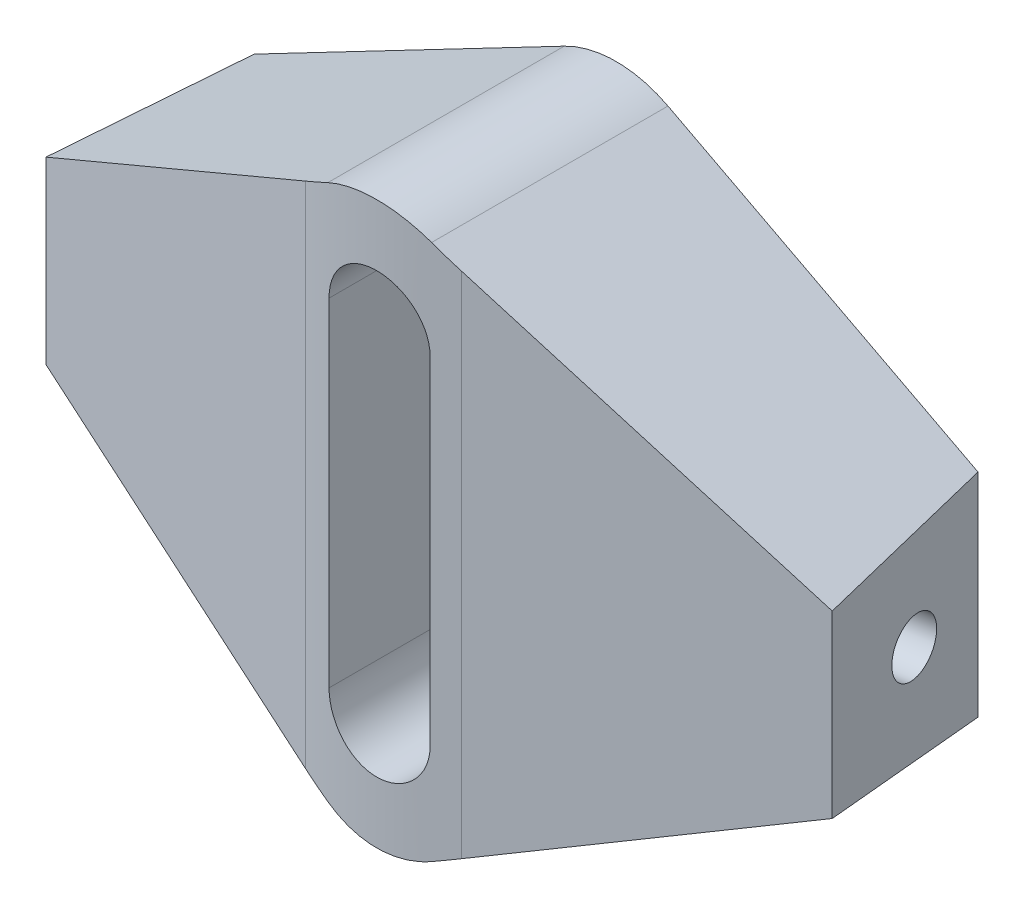
ISO-10303-21;
HEADER;
FILE_DESCRIPTION(('STEP AP214'),'2;1');
FILE_NAME('part.step','',(''),(''),'','','');
FILE_SCHEMA(('AUTOMOTIVE_DESIGN { 1 0 10303 214 1 1 1 1 }'));
ENDSEC;
DATA;
#1=APPLICATION_CONTEXT('core data for automotive mechanical design processes');
#2=APPLICATION_PROTOCOL_DEFINITION('international standard','automotive_design',2000,#1);
#3=PRODUCT_CONTEXT('',#1,'mechanical');
#4=PRODUCT('Part','Part','',(#3));
#5=PRODUCT_RELATED_PRODUCT_CATEGORY('part','',(#4));
#6=PRODUCT_DEFINITION_FORMATION('','',#4);
#7=PRODUCT_DEFINITION_CONTEXT('part definition',#1,'design');
#8=PRODUCT_DEFINITION('design','',#6,#7);
#9=PRODUCT_DEFINITION_SHAPE('','',#8);
#10=(LENGTH_UNIT() NAMED_UNIT(*) SI_UNIT(.MILLI.,.METRE.));
#11=(NAMED_UNIT(*) PLANE_ANGLE_UNIT() SI_UNIT($,.RADIAN.));
#12=(NAMED_UNIT(*) SI_UNIT($,.STERADIAN.) SOLID_ANGLE_UNIT());
#13=UNCERTAINTY_MEASURE_WITH_UNIT(LENGTH_MEASURE(1.E-05),#10,'distance_accuracy_value','');
#14=(GEOMETRIC_REPRESENTATION_CONTEXT(3) GLOBAL_UNCERTAINTY_ASSIGNED_CONTEXT((#13)) GLOBAL_UNIT_ASSIGNED_CONTEXT((#10,
#11,#12)) REPRESENTATION_CONTEXT('',''));
#15=CARTESIAN_POINT('',(0.,0.,0.));
#16=DIRECTION('',(0.,0.,1.));
#17=DIRECTION('',(1.,0.,0.));
#18=AXIS2_PLACEMENT_3D('',#15,#16,#17);
#19=CARTESIAN_POINT('',(16.1108145786646,-12.5,0.));
#20=DIRECTION('',(0.984807753012209,0.,-0.173648177666927));
#21=DIRECTION('',(-0.173648177666927,0.,-0.984807753012209));
#22=AXIS2_PLACEMENT_3D('',#19,#20,#21);
#23=PLANE('',#22);
#24=DIRECTION('',(0.,1.,0.));
#25=VECTOR('',#24,1.);
#26=CARTESIAN_POINT('',(16.1108145786646,0.,0.));
#27=LINE('',#26,#25);
#28=CARTESIAN_POINT('',(16.1108145786646,-4.72548656197076,0.));
#29=VERTEX_POINT('',#28);
#30=CARTESIAN_POINT('',(16.1108145786646,4.72548656197075,0.));
#31=VERTEX_POINT('',#30);
#32=EDGE_CURVE('E144',#29,#31,#27,.T.);
#33=ORIENTED_EDGE('',*,*,#32,.T.);
#34=DIRECTION('',(0.172938517632426,-0.0903152082238665,0.980783070960433));
#35=VECTOR('',#34,1.);
#36=CARTESIAN_POINT('',(19.0950873519284,3.166983455757,16.9246519237916));
#37=LINE('',#36,#35);
#38=CARTESIAN_POINT('',(17.5,3.99999999999999,7.87846202409767));
#39=VERTEX_POINT('',#38);
#40=EDGE_CURVE('E156',#31,#39,#37,.T.);
#41=ORIENTED_EDGE('',*,*,#40,.T.);
#42=DIRECTION('',(0.,1.,0.));
#43=VECTOR('',#42,1.);
#44=CARTESIAN_POINT('',(17.5,-12.5,7.87846202409767));
#45=LINE('',#44,#43);
#46=CARTESIAN_POINT('',(17.5,-4.,7.87846202409767));
#47=VERTEX_POINT('',#46);
#48=EDGE_CURVE('E326',#47,#39,#45,.T.);
#49=ORIENTED_EDGE('',*,*,#48,.F.);
#50=DIRECTION('',(0.172938517632426,0.0903152082238665,0.980783070960433));
#51=VECTOR('',#50,1.);
#52=CARTESIAN_POINT('',(19.0950873519284,-3.166983455757,16.9246519237916));
#53=LINE('',#52,#51);
#54=EDGE_CURVE('E306',#29,#47,#53,.T.);
#55=ORIENTED_EDGE('',*,*,#54,.F.);
#56=EDGE_LOOP('',(#33,#41,#49,#55));
#57=FACE_BOUND('',#56,.T.);
#58=CARTESIAN_POINT('',(16.7185832004988,0.,3.44682713554273));
#59=DIRECTION('',(-0.984807753012209,0.,0.173648177666927));
#60=DIRECTION('',(0.173648177666927,0.,0.984807753012209));
#61=AXIS2_PLACEMENT_3D('',#58,#59,#60);
#62=CIRCLE('',#61,1.23);
#63=CARTESIAN_POINT('',(16.9321704590292,0.,4.65814067174775));
#64=VERTEX_POINT('',#63);
#65=EDGE_CURVE('E335',#64,#64,#62,.T.);
#66=ORIENTED_EDGE('',*,*,#65,.T.);
#67=EDGE_LOOP('',(#66));
#68=FACE_BOUND('',#67,.T.);
#69=ADVANCED_FACE('F36',(#57,#68),#23,.T.);
#70=CARTESIAN_POINT('',(-5.39138022221066,-10.3235913636028,20.));
#71=DIRECTION('',(0.462914129050303,0.886403130142036,0.));
#72=DIRECTION('',(-0.886403130142036,0.462914129050303,0.));
#73=AXIS2_PLACEMENT_3D('',#70,#71,#72);
#74=PLANE('',#73);
#75=CARTESIAN_POINT('',(0.,-13.1391794353007,-9.34434805121913));
#76=DIRECTION('',(0.462914129050303,0.886403130142036,0.));
#77=DIRECTION('',(-0.886403130142036,0.462914129050303,0.));
#78=AXIS2_PLACEMENT_3D('',#75,#76,#77);
#79=ELLIPSE('',#78,22.5630972182998,20.);
#80=CARTESIAN_POINT('',(-3.47296355333856,-11.3254630303738,10.351807009025));
#81=VERTEX_POINT('',#80);
#82=CARTESIAN_POINT('',(-2.30880974382523,-11.9334293478271,10.5219399152536));
#83=VERTEX_POINT('',#82);
#84=EDGE_CURVE('E224',#81,#83,#79,.T.);
#85=ORIENTED_EDGE('',*,*,#84,.F.);
#86=DIRECTION('',(0.875770708624108,-0.457361465731212,0.1544220048446));
#87=VECTOR('',#86,1.);
#88=CARTESIAN_POINT('',(-4.04082844454331,-11.0289019369037,10.2516771073086));
#89=LINE('',#88,#87);
#90=CARTESIAN_POINT('',(-17.5,-4.,7.87846202409767));
#91=VERTEX_POINT('',#90);
#92=EDGE_CURVE('E155',#91,#81,#89,.T.);
#93=ORIENTED_EDGE('',*,*,#92,.F.);
#94=DIRECTION('',(-0.172938517632426,0.0903152082238665,0.980783070960433));
#95=VECTOR('',#94,1.);
#96=CARTESIAN_POINT('',(-19.0950873519284,-3.166983455757,16.9246519237916));
#97=LINE('',#96,#95);
#98=CARTESIAN_POINT('',(-16.1108145786646,-4.72548656197076,0.));
#99=VERTEX_POINT('',#98);
#100=EDGE_CURVE('E138',#99,#91,#97,.T.);
#101=ORIENTED_EDGE('',*,*,#100,.F.);
#102=DIRECTION('',(0.886403130142036,-0.462914129050303,0.));
#103=VECTOR('',#102,1.);
#104=CARTESIAN_POINT('',(-5.39138022221066,-10.3235913636028,0.));
#105=LINE('',#104,#103);
#106=CARTESIAN_POINT('',(-2.30880974382523,-11.9334293478271,0.));
#107=VERTEX_POINT('',#106);
#108=EDGE_CURVE('E153',#99,#107,#105,.T.);
#109=ORIENTED_EDGE('',*,*,#108,.T.);
#110=DIRECTION('',(0.,0.,-1.));
#111=VECTOR('',#110,1.);
#112=CARTESIAN_POINT('',(-2.30880974382523,-11.9334293478271,20.));
#113=LINE('',#112,#111);
#114=EDGE_CURVE('E145',#83,#107,#113,.T.);
#115=ORIENTED_EDGE('',*,*,#114,.F.);
#116=EDGE_LOOP('',(#85,#93,#101,#109,#115));
#117=FACE_BOUND('',#116,.T.);
#118=ADVANCED_FACE('F151',(#117),#74,.F.);
#119=CARTESIAN_POINT('',(0.,-7.51244485978015,20.));
#120=DIRECTION('',(0.,0.,-1.));
#121=DIRECTION('',(-1.,0.,0.));
#122=AXIS2_PLACEMENT_3D('',#119,#120,#121);
#123=CYLINDRICAL_SURFACE('',#122,4.98755514021987);
#124=CARTESIAN_POINT('',(-2.30880974382523,-11.9334293478271,10.5219399152536));
#125=CARTESIAN_POINT('',(-2.18748867748641,-11.9968037626739,10.5360496031578));
#126=CARTESIAN_POINT('',(-2.06346541190383,-12.0552015587296,10.5493273415755));
#127=CARTESIAN_POINT('',(-1.81085966215703,-12.1616645707957,10.5739044822806));
#128=CARTESIAN_POINT('',(-1.68227678686002,-12.2097288978698,10.5852037143517));
#129=CARTESIAN_POINT('',(-1.42160133508556,-12.2950746252358,10.605492612942));
#130=CARTESIAN_POINT('',(-1.28951394133634,-12.3323710745319,10.614485500785));
#131=CARTESIAN_POINT('',(-1.02258073349888,-12.395973870975,10.629940215839));
#132=CARTESIAN_POINT('',(-0.887735082620546,-12.4222808664214,10.6364021923543));
#133=CARTESIAN_POINT('',(-0.616021747323678,-12.463721394292,10.6466256540543));
#134=CARTESIAN_POINT('',(-0.479151264248759,-12.4788376254919,10.6503829574941));
#135=CARTESIAN_POINT('',(-0.204581162158827,-12.4977019611016,10.6550768877698));
#136=CARTESIAN_POINT('',(-0.0668815486817889,-12.5014501413574,10.6560135334246));
#137=CARTESIAN_POINT('',(0.208352484267639,-12.4975466099893,10.655040188063));
#138=CARTESIAN_POINT('',(0.345886894330772,-12.4898942772386,10.6531300419468));
#139=CARTESIAN_POINT('',(0.619721955921612,-12.4632593721777,10.6465171515566));
#140=CARTESIAN_POINT('',(0.756023169097858,-12.4442822517999,10.6418157510425));
#141=CARTESIAN_POINT('',(1.01480058236893,-12.3972845216659,10.6302729041653));
#142=CARTESIAN_POINT('',(1.13745507700392,-12.3701852877371,10.623651059378));
#143=CARTESIAN_POINT('',(1.38024881956069,-12.3068540471235,10.6083387928256));
#144=CARTESIAN_POINT('',(1.50038814778095,-12.2706223324827,10.5996484372091));
#145=CARTESIAN_POINT('',(1.73754976870389,-12.1892333730428,10.5803870432731));
#146=CARTESIAN_POINT('',(1.85456960571935,-12.1440693191422,10.5698145708383));
#147=CARTESIAN_POINT('',(2.08474786211003,-12.0451317763272,10.5470389133088));
#148=CARTESIAN_POINT('',(2.19790628548275,-11.9913582963261,10.5348357299024));
#149=CARTESIAN_POINT('',(2.30880974382523,-11.9334293478271,10.5219399152536));
#150=B_SPLINE_CURVE_WITH_KNOTS('',3,(#124,#125,#126,#127,#128,#129,#130,#131,#132,#133,#134,
#135,#136,#137,#138,#139,#140,#141,#142,#143,#144,#145,#146,#147,#148,#149),.UNSPECIFIED.,.F.,
.F.,(4,2,2,2,2,2,2,2,2,2,2,2,4),(0.,0.412695108790664,0.825425705475821,1.23757665320062,
1.64970328352615,2.06246574973173,2.47522546204235,2.88800766329875,3.3005913047803,
3.67758281135736,4.05456226379936,4.43183020219751,4.80909775002098),.UNSPECIFIED.);
#151=CARTESIAN_POINT('',(2.30880974382523,-11.9334293478271,10.5219399152536));
#152=VERTEX_POINT('',#151);
#153=EDGE_CURVE('E287',#83,#152,#150,.T.);
#154=ORIENTED_EDGE('',*,*,#153,.F.);
#155=ORIENTED_EDGE('',*,*,#114,.T.);
#156=CARTESIAN_POINT('',(0.,-7.51244485978015,0.));
#157=DIRECTION('',(0.,0.,1.));
#158=DIRECTION('',(1.,0.,0.));
#159=AXIS2_PLACEMENT_3D('',#156,#157,#158);
#160=CIRCLE('',#159,4.98755514021987);
#161=CARTESIAN_POINT('',(2.30880974382523,-11.9334293478271,0.));
#162=VERTEX_POINT('',#161);
#163=EDGE_CURVE('E161',#107,#162,#160,.T.);
#164=ORIENTED_EDGE('',*,*,#163,.T.);
#165=DIRECTION('',(0.,0.,-1.));
#166=VECTOR('',#165,1.);
#167=CARTESIAN_POINT('',(2.30880974382523,-11.9334293478271,20.));
#168=LINE('',#167,#166);
#169=EDGE_CURVE('E186',#152,#162,#168,.T.);
#170=ORIENTED_EDGE('',*,*,#169,.F.);
#171=EDGE_LOOP('',(#154,#155,#164,#170));
#172=FACE_BOUND('',#171,.T.);
#173=ADVANCED_FACE('F280',(#172),#123,.T.);
#174=CARTESIAN_POINT('',(5.39138022221066,-10.3235913636028,20.));
#175=DIRECTION('',(0.462914129050303,-0.886403130142036,0.));
#176=DIRECTION('',(0.886403130142036,0.462914129050303,0.));
#177=AXIS2_PLACEMENT_3D('',#174,#175,#176);
#178=PLANE('',#177);
#179=DIRECTION('',(-0.886403130142036,-0.462914129050303,0.));
#180=VECTOR('',#179,1.);
#181=CARTESIAN_POINT('',(5.39138022221066,-10.3235913636028,0.));
#182=LINE('',#181,#180);
#183=EDGE_CURVE('E164',#29,#162,#182,.T.);
#184=ORIENTED_EDGE('',*,*,#183,.F.);
#185=ORIENTED_EDGE('',*,*,#54,.T.);
#186=DIRECTION('',(-0.875770708624108,-0.457361465731212,0.154422004844599));
#187=VECTOR('',#186,1.);
#188=CARTESIAN_POINT('',(4.04082844454331,-11.0289019369037,10.2516771073086));
#189=LINE('',#188,#187);
#190=CARTESIAN_POINT('',(3.47296355333855,-11.3254630303738,10.351807009025));
#191=VERTEX_POINT('',#190);
#192=EDGE_CURVE('E220',#47,#191,#189,.T.);
#193=ORIENTED_EDGE('',*,*,#192,.T.);
#194=CARTESIAN_POINT('',(0.,-13.1391794353007,-9.34434805121913));
#195=DIRECTION('',(0.462914129050303,-0.886403130142036,0.));
#196=DIRECTION('',(0.886403130142036,0.462914129050303,0.));
#197=AXIS2_PLACEMENT_3D('',#194,#195,#196);
#198=ELLIPSE('',#197,22.5630972182998,20.);
#199=EDGE_CURVE('E291',#191,#152,#198,.T.);
#200=ORIENTED_EDGE('',*,*,#199,.T.);
#201=ORIENTED_EDGE('',*,*,#169,.T.);
#202=EDGE_LOOP('',(#184,#185,#193,#200,#201));
#203=FACE_BOUND('',#202,.T.);
#204=ADVANCED_FACE('F276',(#203),#178,.T.);
#205=CARTESIAN_POINT('',(5.39138022221066,10.3235913636028,20.));
#206=DIRECTION('',(-0.462914129050303,-0.886403130142036,0.));
#207=DIRECTION('',(0.886403130142036,-0.462914129050303,0.));
#208=AXIS2_PLACEMENT_3D('',#205,#206,#207);
#209=PLANE('',#208);
#210=ORIENTED_EDGE('',*,*,#40,.F.);
#211=DIRECTION('',(-0.886403130142036,0.462914129050303,0.));
#212=VECTOR('',#211,1.);
#213=CARTESIAN_POINT('',(5.39138022221066,10.3235913636028,0.));
#214=LINE('',#213,#212);
#215=CARTESIAN_POINT('',(2.30880974382523,11.9334293478271,0.));
#216=VERTEX_POINT('',#215);
#217=EDGE_CURVE('E172',#31,#216,#214,.T.);
#218=ORIENTED_EDGE('',*,*,#217,.T.);
#219=DIRECTION('',(0.,0.,-1.));
#220=VECTOR('',#219,1.);
#221=CARTESIAN_POINT('',(2.30880974382523,11.9334293478271,20.));
#222=LINE('',#221,#220);
#223=CARTESIAN_POINT('',(2.30880974382523,11.9334293478271,10.5219399152536));
#224=VERTEX_POINT('',#223);
#225=EDGE_CURVE('E182',#224,#216,#222,.T.);
#226=ORIENTED_EDGE('',*,*,#225,.F.);
#227=CARTESIAN_POINT('',(0.,13.1391794353007,-9.34434805121913));
#228=DIRECTION('',(-0.462914129050303,-0.886403130142036,0.));
#229=DIRECTION('',(-0.886403130142036,0.462914129050303,0.));
#230=AXIS2_PLACEMENT_3D('',#227,#228,#229);
#231=ELLIPSE('',#230,22.5630972182998,20.);
#232=CARTESIAN_POINT('',(3.47296355333855,11.3254630303738,10.351807009025));
#233=VERTEX_POINT('',#232);
#234=EDGE_CURVE('E263',#233,#224,#231,.T.);
#235=ORIENTED_EDGE('',*,*,#234,.F.);
#236=DIRECTION('',(-0.875770708624108,0.457361465731212,0.154422004844599));
#237=VECTOR('',#236,1.);
#238=CARTESIAN_POINT('',(4.04082844454331,11.0289019369037,10.2516771073086));
#239=LINE('',#238,#237);
#240=EDGE_CURVE('E12',#39,#233,#239,.T.);
#241=ORIENTED_EDGE('',*,*,#240,.F.);
#242=EDGE_LOOP('',(#210,#218,#226,#235,#241));
#243=FACE_BOUND('',#242,.T.);
#244=ADVANCED_FACE('F271',(#243),#209,.F.);
#245=CARTESIAN_POINT('',(0.,7.51244485978015,20.));
#246=DIRECTION('',(0.,0.,-1.));
#247=DIRECTION('',(-1.,0.,0.));
#248=AXIS2_PLACEMENT_3D('',#245,#246,#247);
#249=CYLINDRICAL_SURFACE('',#248,4.98755514021987);
#250=DIRECTION('',(0.,0.,-1.));
#251=VECTOR('',#250,1.);
#252=CARTESIAN_POINT('',(-2.30880974382523,11.9334293478271,20.));
#253=LINE('',#252,#251);
#254=CARTESIAN_POINT('',(-2.30880974382523,11.9334293478271,10.5219399152536));
#255=VERTEX_POINT('',#254);
#256=CARTESIAN_POINT('',(-2.30880974382523,11.9334293478271,0.));
#257=VERTEX_POINT('',#256);
#258=EDGE_CURVE('E180',#255,#257,#253,.T.);
#259=ORIENTED_EDGE('',*,*,#258,.F.);
#260=CARTESIAN_POINT('',(-2.30880974382523,11.9334293478271,10.5219399152536));
#261=CARTESIAN_POINT('',(-2.18748867748641,11.9968037626739,10.5360496031578));
#262=CARTESIAN_POINT('',(-2.06346541190383,12.0552015587296,10.5493273415755));
#263=CARTESIAN_POINT('',(-1.81085966215703,12.1616645707957,10.5739044822806));
#264=CARTESIAN_POINT('',(-1.68227678686002,12.2097288978698,10.5852037143517));
#265=CARTESIAN_POINT('',(-1.42160133508556,12.2950746252358,10.605492612942));
#266=CARTESIAN_POINT('',(-1.28951394133634,12.3323710745319,10.614485500785));
#267=CARTESIAN_POINT('',(-1.02258073349888,12.395973870975,10.629940215839));
#268=CARTESIAN_POINT('',(-0.887735082620547,12.4222808664214,10.6364021923543));
#269=CARTESIAN_POINT('',(-0.616021747323679,12.463721394292,10.6466256540543));
#270=CARTESIAN_POINT('',(-0.47915126424876,12.4788376254919,10.6503829574941));
#271=CARTESIAN_POINT('',(-0.204581162158828,12.4977019611016,10.6550768877698));
#272=CARTESIAN_POINT('',(-0.0668815486817902,12.5014501413574,10.6560135334246));
#273=CARTESIAN_POINT('',(0.208352484267637,12.4975466099893,10.6550401880631));
#274=CARTESIAN_POINT('',(0.34588689433077,12.4898942772386,10.6531300419468));
#275=CARTESIAN_POINT('',(0.619721955921611,12.4632593721777,10.6465171515566));
#276=CARTESIAN_POINT('',(0.756023169097856,12.4442822517999,10.6418157510425));
#277=CARTESIAN_POINT('',(1.01480058236893,12.3972845216659,10.6302729041653));
#278=CARTESIAN_POINT('',(1.13745507700392,12.3701852877371,10.623651059378));
#279=CARTESIAN_POINT('',(1.38024881956069,12.3068540471235,10.6083387928256));
#280=CARTESIAN_POINT('',(1.50038814778095,12.2706223324827,10.5996484372091));
#281=CARTESIAN_POINT('',(1.73754976870389,12.1892333730428,10.5803870432731));
#282=CARTESIAN_POINT('',(1.85456960571935,12.1440693191422,10.5698145708383));
#283=CARTESIAN_POINT('',(2.08474786211003,12.0451317763272,10.5470389133088));
#284=CARTESIAN_POINT('',(2.19790628548274,11.9913582963261,10.5348357299024));
#285=CARTESIAN_POINT('',(2.30880974382523,11.9334293478271,10.5219399152536));
#286=B_SPLINE_CURVE_WITH_KNOTS('',3,(#260,#261,#262,#263,#264,#265,#266,#267,#268,#269,#270,
#271,#272,#273,#274,#275,#276,#277,#278,#279,#280,#281,#282,#283,#284,#285),.UNSPECIFIED.,.F.,
.F.,(4,2,2,2,2,2,2,2,2,2,2,2,4),(0.,0.412695108790664,0.825425705475821,1.23757665320062,
1.64970328352615,2.06246574973173,2.47522546204234,2.88800766329874,3.30059130478029,
3.67758281135736,4.05456226379936,4.4318302021975,4.80909775002098),.UNSPECIFIED.);
#287=EDGE_CURVE('E257',#255,#224,#286,.T.);
#288=ORIENTED_EDGE('',*,*,#287,.T.);
#289=ORIENTED_EDGE('',*,*,#225,.T.);
#290=CARTESIAN_POINT('',(0.,7.51244485978015,0.));
#291=DIRECTION('',(0.,0.,1.));
#292=DIRECTION('',(1.,0.,0.));
#293=AXIS2_PLACEMENT_3D('',#290,#291,#292);
#294=CIRCLE('',#293,4.98755514021987);
#295=EDGE_CURVE('E175',#257,#216,#294,.F.);
#296=ORIENTED_EDGE('',*,*,#295,.F.);
#297=EDGE_LOOP('',(#259,#288,#289,#296));
#298=FACE_BOUND('',#297,.T.);
#299=ADVANCED_FACE('F265',(#298),#249,.T.);
#300=CARTESIAN_POINT('',(-5.39138022221066,10.3235913636028,20.));
#301=DIRECTION('',(-0.462914129050303,0.886403130142036,0.));
#302=DIRECTION('',(-0.886403130142036,-0.462914129050303,0.));
#303=AXIS2_PLACEMENT_3D('',#300,#301,#302);
#304=PLANE('',#303);
#305=DIRECTION('',(0.875770708624108,0.457361465731212,0.1544220048446));
#306=VECTOR('',#305,1.);
#307=CARTESIAN_POINT('',(-4.04082844454331,11.0289019369037,10.2516771073086));
#308=LINE('',#307,#306);
#309=CARTESIAN_POINT('',(-17.5,3.99999999999999,7.87846202409767));
#310=VERTEX_POINT('',#309);
#311=CARTESIAN_POINT('',(-3.47296355333855,11.3254630303738,10.351807009025));
#312=VERTEX_POINT('',#311);
#313=EDGE_CURVE('E311',#310,#312,#308,.T.);
#314=ORIENTED_EDGE('',*,*,#313,.T.);
#315=CARTESIAN_POINT('',(0.,13.1391794353007,-9.34434805121913));
#316=DIRECTION('',(-0.462914129050303,0.886403130142036,0.));
#317=DIRECTION('',(0.886403130142036,0.462914129050303,0.));
#318=AXIS2_PLACEMENT_3D('',#315,#316,#317);
#319=ELLIPSE('',#318,22.5630972182998,20.);
#320=EDGE_CURVE('E207',#312,#255,#319,.T.);
#321=ORIENTED_EDGE('',*,*,#320,.T.);
#322=ORIENTED_EDGE('',*,*,#258,.T.);
#323=DIRECTION('',(0.886403130142036,0.462914129050303,0.));
#324=VECTOR('',#323,1.);
#325=CARTESIAN_POINT('',(-5.39138022221066,10.3235913636028,0.));
#326=LINE('',#325,#324);
#327=CARTESIAN_POINT('',(-16.1108145786646,4.72548656197076,0.));
#328=VERTEX_POINT('',#327);
#329=EDGE_CURVE('E177',#328,#257,#326,.T.);
#330=ORIENTED_EDGE('',*,*,#329,.F.);
#331=DIRECTION('',(-0.172938517632426,-0.0903152082238665,0.980783070960433));
#332=VECTOR('',#331,1.);
#333=CARTESIAN_POINT('',(-19.0950873519284,3.166983455757,16.9246519237916));
#334=LINE('',#333,#332);
#335=EDGE_CURVE('E60',#328,#310,#334,.T.);
#336=ORIENTED_EDGE('',*,*,#335,.T.);
#337=EDGE_LOOP('',(#314,#321,#322,#330,#336));
#338=FACE_BOUND('',#337,.T.);
#339=ADVANCED_FACE('F270',(#338),#304,.T.);
#340=CARTESIAN_POINT('',(0.,7.51244485978015,20.));
#341=DIRECTION('',(0.,0.,-1.));
#342=DIRECTION('',(-1.,0.,0.));
#343=AXIS2_PLACEMENT_3D('',#340,#341,#342);
#344=CYLINDRICAL_SURFACE('',#343,2.25);
#345=DIRECTION('',(0.,0.,-1.));
#346=VECTOR('',#345,1.);
#347=CARTESIAN_POINT('',(2.25,7.51244485978015,20.));
#348=LINE('',#347,#346);
#349=CARTESIAN_POINT('',(2.25,7.51244485978015,10.5286864427881));
#350=VERTEX_POINT('',#349);
#351=CARTESIAN_POINT('',(2.25,7.51244485978015,0.));
#352=VERTEX_POINT('',#351);
#353=EDGE_CURVE('E183',#350,#352,#348,.T.);
#354=ORIENTED_EDGE('',*,*,#353,.F.);
#355=CARTESIAN_POINT('',(2.25,7.51244485978015,10.5286864427881));
#356=CARTESIAN_POINT('',(2.24999981834973,7.57553336458192,10.5286847199834));
#357=CARTESIAN_POINT('',(2.24734489031851,7.63859144859624,10.5289872448017));
#358=CARTESIAN_POINT('',(2.23675486634087,7.76425246366442,10.5301826254157));
#359=CARTESIAN_POINT('',(2.22882014754874,7.82685542690629,10.531075439045));
#360=CARTESIAN_POINT('',(2.19717887631467,8.01317320112749,10.5346077654562));
#361=CARTESIAN_POINT('',(2.16563495617706,8.13563372811299,10.5381012958475));
#362=CARTESIAN_POINT('',(2.08255229295352,8.37347467970841,10.546974173957));
#363=CARTESIAN_POINT('',(2.03100648638886,8.48885258646811,10.5523541878044));
#364=CARTESIAN_POINT('',(1.90940115019305,8.70932672710842,10.5643913937831));
#365=CARTESIAN_POINT('',(1.8393434796092,8.81442399196745,10.5710484576487));
#366=CARTESIAN_POINT('',(1.68237119375747,9.01180934005758,10.5849229088055));
#367=CARTESIAN_POINT('',(1.595390740805,9.1040448978489,10.5921424162753));
#368=CARTESIAN_POINT('',(1.40717183353723,9.27265298854349,10.6063100128893));
#369=CARTESIAN_POINT('',(1.30593121133241,9.34902310514019,10.6132580605595));
#370=CARTESIAN_POINT('',(1.09174158430743,9.48390617220076,10.6261207361433));
#371=CARTESIAN_POINT('',(0.978762329645395,9.54237137341306,10.6320325830633));
#372=CARTESIAN_POINT('',(0.744518780663257,9.63947663498934,10.6421328514608));
#373=CARTESIAN_POINT('',(0.623255233735557,9.67811848110757,10.6463214281697));
#374=CARTESIAN_POINT('',(0.376423789207964,9.7343266101197,10.6524885455419));
#375=CARTESIAN_POINT('',(0.250876286478719,9.75198142016725,10.6544763669369));
#376=CARTESIAN_POINT('',(-0.00141740258608267,9.76598856411787,10.6560496513785));
#377=CARTESIAN_POINT('',(-0.128163579383982,9.76234106737784,10.655635133524));
#378=CARTESIAN_POINT('',(-0.378648308137059,9.73391779699926,10.6524579098926));
#379=CARTESIAN_POINT('',(-0.502397885230162,9.7092378268674,10.649705851865));
#380=CARTESIAN_POINT('',(-0.743986756542818,9.63959977914676,10.6421748965449));
#381=CARTESIAN_POINT('',(-0.861825987611552,9.59464148493956,10.6373959776009));
#382=CARTESIAN_POINT('',(-1.08855142753239,9.48561850372322,10.626329975042));
#383=CARTESIAN_POINT('',(-1.19741711368342,9.42151148996171,10.6200395564623));
#384=CARTESIAN_POINT('',(-1.402875909285,9.27604431770102,10.6066558111259));
#385=CARTESIAN_POINT('',(-1.49946909632613,9.19468426828963,10.5995624894458));
#386=CARTESIAN_POINT('',(-1.67819583731279,9.01649577729512,10.5853222104217));
#387=CARTESIAN_POINT('',(-1.7602483457537,8.91958604068857,10.5781751705044));
#388=CARTESIAN_POINT('',(-1.90695929778882,8.71328912701965,10.5646688442978));
#389=CARTESIAN_POINT('',(-1.97161250949913,8.603898210976,10.5583097952628));
#390=CARTESIAN_POINT('',(-2.08168995749662,8.3756626175864,10.5470984286457));
#391=CARTESIAN_POINT('',(-2.12709698005098,8.25680958971631,10.542247460916));
#392=CARTESIAN_POINT('',(-2.19721914736141,8.0131866128966,10.5346230736645));
#393=CARTESIAN_POINT('',(-2.22196552372431,7.88842589709965,10.5318465190327));
#394=CARTESIAN_POINT('',(-2.24070092433873,7.72105769995118,10.5297372834917));
#395=CARTESIAN_POINT('',(-2.24418977322343,7.67937544100607,10.5293434819665));
#396=CARTESIAN_POINT('',(-2.24883617633498,7.5959495778847,10.5288183773366));
#397=CARTESIAN_POINT('',(-2.24999762925207,7.55420619371504,10.528686635251));
#398=CARTESIAN_POINT('',(-2.25,7.51244485978015,10.5286864427881));
#399=B_SPLINE_CURVE_WITH_KNOTS('',3,(#355,#356,#357,#358,#359,#360,#361,#362,#363,#364,#365,
#366,#367,#368,#369,#370,#371,#372,#373,#374,#375,#376,#377,#378,#379,#380,#381,#382,#383,#384,
#385,#386,#387,#388,#389,#390,#391,#392,#393,#394,#395,#396,#397,#398),.UNSPECIFIED.,.F.,.F.,(4,
2,2,2,2,2,2,2,2,2,2,2,2,2,2,2,2,2,2,2,2,4),(0.,0.189148634216167,0.378283758321521,
0.755852600124273,1.13355489834568,1.5112192803555,1.89038344838192,2.26960532084141,
2.64982987713446,3.03002017550802,3.40860100575688,3.78717882622908,4.16404137498131,
4.5409079495741,4.91861380179391,5.29631726591987,5.67606390579928,6.0559246063822,
6.43612433995169,6.81574829971238,6.94119038484395,7.0664221619569),.UNSPECIFIED.);
#400=CARTESIAN_POINT('',(-2.25,7.51244485978015,10.5286864427881));
#401=VERTEX_POINT('',#400);
#402=EDGE_CURVE('E199',#350,#401,#399,.T.);
#403=ORIENTED_EDGE('',*,*,#402,.T.);
#404=DIRECTION('',(0.,0.,-1.));
#405=VECTOR('',#404,1.);
#406=CARTESIAN_POINT('',(-2.25,7.51244485978015,20.));
#407=LINE('',#406,#405);
#408=CARTESIAN_POINT('',(-2.25,7.51244485978015,0.));
#409=VERTEX_POINT('',#408);
#410=EDGE_CURVE('E179',#401,#409,#407,.T.);
#411=ORIENTED_EDGE('',*,*,#410,.T.);
#412=CARTESIAN_POINT('',(0.,7.51244485978015,0.));
#413=DIRECTION('',(0.,0.,1.));
#414=DIRECTION('',(1.,0.,0.));
#415=AXIS2_PLACEMENT_3D('',#412,#413,#414);
#416=CIRCLE('',#415,2.25);
#417=EDGE_CURVE('E217',#352,#409,#416,.T.);
#418=ORIENTED_EDGE('',*,*,#417,.F.);
#419=EDGE_LOOP('',(#354,#403,#411,#418));
#420=FACE_BOUND('',#419,.T.);
#421=ADVANCED_FACE('F38',(#420),#344,.F.);
#422=CARTESIAN_POINT('',(2.25,0.,20.));
#423=DIRECTION('',(-1.,0.,0.));
#424=DIRECTION('',(0.,0.,1.));
#425=AXIS2_PLACEMENT_3D('',#422,#423,#424);
#426=PLANE('',#425);
#427=DIRECTION('',(0.,0.,-1.));
#428=VECTOR('',#427,1.);
#429=CARTESIAN_POINT('',(2.25,-7.51244485978015,20.));
#430=LINE('',#429,#428);
#431=CARTESIAN_POINT('',(2.25,-7.51244485978015,10.5286864427881));
#432=VERTEX_POINT('',#431);
#433=CARTESIAN_POINT('',(2.25,-7.51244485978015,0.));
#434=VERTEX_POINT('',#433);
#435=EDGE_CURVE('E193',#432,#434,#430,.T.);
#436=ORIENTED_EDGE('',*,*,#435,.F.);
#437=DIRECTION('',(0.,1.,0.));
#438=VECTOR('',#437,1.);
#439=CARTESIAN_POINT('',(2.25,-12.5,10.5286864427881));
#440=LINE('',#439,#438);
#441=EDGE_CURVE('E208',#432,#350,#440,.T.);
#442=ORIENTED_EDGE('',*,*,#441,.T.);
#443=ORIENTED_EDGE('',*,*,#353,.T.);
#444=DIRECTION('',(0.,1.,0.));
#445=VECTOR('',#444,1.);
#446=CARTESIAN_POINT('',(2.25,0.,0.));
#447=LINE('',#446,#445);
#448=EDGE_CURVE('E219',#434,#352,#447,.T.);
#449=ORIENTED_EDGE('',*,*,#448,.F.);
#450=EDGE_LOOP('',(#436,#442,#443,#449));
#451=FACE_BOUND('',#450,.T.);
#452=ADVANCED_FACE('F231',(#451),#426,.T.);
#453=CARTESIAN_POINT('',(0.,-7.51244485978015,20.));
#454=DIRECTION('',(0.,0.,-1.));
#455=DIRECTION('',(-1.,0.,0.));
#456=AXIS2_PLACEMENT_3D('',#453,#454,#455);
#457=CYLINDRICAL_SURFACE('',#456,2.25);
#458=DIRECTION('',(0.,0.,-1.));
#459=VECTOR('',#458,1.);
#460=CARTESIAN_POINT('',(-2.25,-7.51244485978015,20.));
#461=LINE('',#460,#459);
#462=CARTESIAN_POINT('',(-2.25,-7.51244485978015,10.5286864427881));
#463=VERTEX_POINT('',#462);
#464=CARTESIAN_POINT('',(-2.25,-7.51244485978015,0.));
#465=VERTEX_POINT('',#464);
#466=EDGE_CURVE('E191',#463,#465,#461,.T.);
#467=ORIENTED_EDGE('',*,*,#466,.F.);
#468=CARTESIAN_POINT('',(-2.25,-7.51244485978015,10.5286864427881));
#469=CARTESIAN_POINT('',(-2.24999981834973,-7.57553336458192,10.5286847199834));
#470=CARTESIAN_POINT('',(-2.2473448903185,-7.63859144859624,10.5289872448017));
#471=CARTESIAN_POINT('',(-2.23675486634087,-7.76425246366442,10.5301826254157));
#472=CARTESIAN_POINT('',(-2.22882014754874,-7.82685542690629,10.531075439045));
#473=CARTESIAN_POINT('',(-2.19717887631467,-8.01317320112749,10.5346077654562));
#474=CARTESIAN_POINT('',(-2.16563495617706,-8.13563372811299,10.5381012958475));
#475=CARTESIAN_POINT('',(-2.08255229295351,-8.37347467970841,10.546974173957));
#476=CARTESIAN_POINT('',(-2.03100648638886,-8.48885258646811,10.5523541878044));
#477=CARTESIAN_POINT('',(-1.90940115019305,-8.70932672710842,10.5643913937831));
#478=CARTESIAN_POINT('',(-1.8393434796092,-8.81442399196745,10.5710484576487));
#479=CARTESIAN_POINT('',(-1.68237119375747,-9.01180934005758,10.5849229088055));
#480=CARTESIAN_POINT('',(-1.59539074080499,-9.1040448978489,10.5921424162753));
#481=CARTESIAN_POINT('',(-1.40717183353722,-9.27265298854349,10.6063100128893));
#482=CARTESIAN_POINT('',(-1.30593121133241,-9.34902310514019,10.6132580605595));
#483=CARTESIAN_POINT('',(-1.09174158430743,-9.48390617220076,10.6261207361433));
#484=CARTESIAN_POINT('',(-0.978762329645388,-9.54237137341306,10.6320325830633));
#485=CARTESIAN_POINT('',(-0.74451878066325,-9.63947663498934,10.6421328514608));
#486=CARTESIAN_POINT('',(-0.623255233735551,-9.67811848110757,10.6463214281697));
#487=CARTESIAN_POINT('',(-0.376423789207958,-9.7343266101197,10.6524885455419));
#488=CARTESIAN_POINT('',(-0.250876286478712,-9.75198142016725,10.6544763669369));
#489=CARTESIAN_POINT('',(0.00141740258608887,-9.76598856411787,10.6560496513785));
#490=CARTESIAN_POINT('',(0.128163579383988,-9.76234106737784,10.6556351335241));
#491=CARTESIAN_POINT('',(0.378648308137065,-9.73391779699926,10.6524579098926));
#492=CARTESIAN_POINT('',(0.502397885230168,-9.7092378268674,10.649705851865));
#493=CARTESIAN_POINT('',(0.743986756542823,-9.63959977914676,10.6421748965449));
#494=CARTESIAN_POINT('',(0.861825987611557,-9.59464148493956,10.6373959776009));
#495=CARTESIAN_POINT('',(1.08855142753239,-9.48561850372322,10.626329975042));
#496=CARTESIAN_POINT('',(1.19741711368343,-9.42151148996171,10.6200395564623));
#497=CARTESIAN_POINT('',(1.402875909285,-9.27604431770102,10.6066558111259));
#498=CARTESIAN_POINT('',(1.49946909632613,-9.19468426828963,10.5995624894459));
#499=CARTESIAN_POINT('',(1.67819583731279,-9.01649577729511,10.5853222104217));
#500=CARTESIAN_POINT('',(1.7602483457537,-8.91958604068856,10.5781751705044));
#501=CARTESIAN_POINT('',(1.90695929778882,-8.71328912701965,10.5646688442978));
#502=CARTESIAN_POINT('',(1.97161250949913,-8.60389821097599,10.5583097952628));
#503=CARTESIAN_POINT('',(2.08168995749662,-8.3756626175864,10.5470984286457));
#504=CARTESIAN_POINT('',(2.12709698005098,-8.2568095897163,10.542247460916));
#505=CARTESIAN_POINT('',(2.19721914736141,-8.01318661289659,10.5346230736645));
#506=CARTESIAN_POINT('',(2.22196552372431,-7.88842589709965,10.5318465190327));
#507=CARTESIAN_POINT('',(2.24070092433873,-7.72105769995118,10.5297372834917));
#508=CARTESIAN_POINT('',(2.24418977322343,-7.67937544100607,10.5293434819665));
#509=CARTESIAN_POINT('',(2.24883617633499,-7.59594957788469,10.5288183773366));
#510=CARTESIAN_POINT('',(2.24999762925207,-7.55420619371503,10.528686635251));
#511=CARTESIAN_POINT('',(2.25,-7.51244485978015,10.5286864427881));
#512=B_SPLINE_CURVE_WITH_KNOTS('',3,(#468,#469,#470,#471,#472,#473,#474,#475,#476,#477,#478,
#479,#480,#481,#482,#483,#484,#485,#486,#487,#488,#489,#490,#491,#492,#493,#494,#495,#496,#497,
#498,#499,#500,#501,#502,#503,#504,#505,#506,#507,#508,#509,#510,#511),.UNSPECIFIED.,.F.,.F.,(4,
2,2,2,2,2,2,2,2,2,2,2,2,2,2,2,2,2,2,2,2,4),(0.,0.189148634216167,0.378283758321521,
0.755852600124274,1.13355489834568,1.5112192803555,1.89038344838192,2.26960532084141,
2.64982987713446,3.03002017550802,3.40860100575688,3.78717882622908,4.16404137498132,
4.5409079495741,4.91861380179391,5.29631726591987,5.67606390579928,6.0559246063822,
6.43612433995169,6.81574829971238,6.94119038484395,7.0664221619569),.UNSPECIFIED.);
#513=EDGE_CURVE('E52',#463,#432,#512,.T.);
#514=ORIENTED_EDGE('',*,*,#513,.T.);
#515=ORIENTED_EDGE('',*,*,#435,.T.);
#516=CARTESIAN_POINT('',(0.,-7.51244485978015,0.));
#517=DIRECTION('',(0.,0.,1.));
#518=DIRECTION('',(1.,0.,0.));
#519=AXIS2_PLACEMENT_3D('',#516,#517,#518);
#520=CIRCLE('',#519,2.25);
#521=EDGE_CURVE('E167',#465,#434,#520,.T.);
#522=ORIENTED_EDGE('',*,*,#521,.F.);
#523=EDGE_LOOP('',(#467,#514,#515,#522));
#524=FACE_BOUND('',#523,.T.);
#525=ADVANCED_FACE('F228',(#524),#457,.F.);
#526=CARTESIAN_POINT('',(-2.25,0.,20.));
#527=DIRECTION('',(-1.,0.,0.));
#528=DIRECTION('',(0.,0.,1.));
#529=AXIS2_PLACEMENT_3D('',#526,#527,#528);
#530=PLANE('',#529);
#531=DIRECTION('',(0.,1.,0.));
#532=VECTOR('',#531,1.);
#533=CARTESIAN_POINT('',(-2.25,-12.5,10.5286864427881));
#534=LINE('',#533,#532);
#535=EDGE_CURVE('E45',#463,#401,#534,.T.);
#536=ORIENTED_EDGE('',*,*,#535,.F.);
#537=ORIENTED_EDGE('',*,*,#466,.T.);
#538=DIRECTION('',(0.,1.,0.));
#539=VECTOR('',#538,1.);
#540=CARTESIAN_POINT('',(-2.25,0.,0.));
#541=LINE('',#540,#539);
#542=EDGE_CURVE('E162',#465,#409,#541,.T.);
#543=ORIENTED_EDGE('',*,*,#542,.T.);
#544=ORIENTED_EDGE('',*,*,#410,.F.);
#545=EDGE_LOOP('',(#536,#537,#543,#544));
#546=FACE_BOUND('',#545,.T.);
#547=ADVANCED_FACE('F210',(#546),#530,.F.);
#548=CARTESIAN_POINT('',(0.,0.,0.));
#549=DIRECTION('',(0.,0.,1.));
#550=DIRECTION('',(1.,0.,0.));
#551=AXIS2_PLACEMENT_3D('',#548,#549,#550);
#552=PLANE('',#551);
#553=ORIENTED_EDGE('',*,*,#417,.T.);
#554=ORIENTED_EDGE('',*,*,#542,.F.);
#555=ORIENTED_EDGE('',*,*,#521,.T.);
#556=ORIENTED_EDGE('',*,*,#448,.T.);
#557=EDGE_LOOP('',(#553,#554,#555,#556));
#558=FACE_BOUND('',#557,.T.);
#559=ORIENTED_EDGE('',*,*,#32,.F.);
#560=ORIENTED_EDGE('',*,*,#183,.T.);
#561=ORIENTED_EDGE('',*,*,#163,.F.);
#562=ORIENTED_EDGE('',*,*,#108,.F.);
#563=DIRECTION('',(0.,-1.,0.));
#564=VECTOR('',#563,1.);
#565=CARTESIAN_POINT('',(-16.1108145786646,0.,0.));
#566=LINE('',#565,#564);
#567=EDGE_CURVE('E135',#328,#99,#566,.T.);
#568=ORIENTED_EDGE('',*,*,#567,.F.);
#569=ORIENTED_EDGE('',*,*,#329,.T.);
#570=ORIENTED_EDGE('',*,*,#295,.T.);
#571=ORIENTED_EDGE('',*,*,#217,.F.);
#572=EDGE_LOOP('',(#559,#560,#561,#562,#568,#569,#570,#571));
#573=FACE_BOUND('',#572,.T.);
#574=ADVANCED_FACE('F159',(#558,#573),#552,.F.);
#575=CARTESIAN_POINT('',(17.5,-12.5,7.87846202409767));
#576=DIRECTION('',(0.173648177666928,0.,0.984807753012208));
#577=DIRECTION('',(0.984807753012209,0.,-0.173648177666928));
#578=AXIS2_PLACEMENT_3D('',#575,#576,#577);
#579=PLANE('',#578);
#580=ORIENTED_EDGE('',*,*,#48,.T.);
#581=ORIENTED_EDGE('',*,*,#240,.T.);
#582=DIRECTION('',(0.,1.,0.));
#583=VECTOR('',#582,1.);
#584=CARTESIAN_POINT('',(3.47296355333855,-12.5,10.351807009025));
#585=LINE('',#584,#583);
#586=EDGE_CURVE('E320',#191,#233,#585,.T.);
#587=ORIENTED_EDGE('',*,*,#586,.F.);
#588=ORIENTED_EDGE('',*,*,#192,.F.);
#589=EDGE_LOOP('',(#580,#581,#587,#588));
#590=FACE_BOUND('',#589,.T.);
#591=ADVANCED_FACE('F250',(#590),#579,.T.);
#592=CARTESIAN_POINT('',(0.,-12.5,-9.34434805121913));
#593=DIRECTION('',(0.,1.,0.));
#594=DIRECTION('',(0.,0.,1.));
#595=AXIS2_PLACEMENT_3D('',#592,#593,#594);
#596=CYLINDRICAL_SURFACE('',#595,20.);
#597=ORIENTED_EDGE('',*,*,#441,.F.);
#598=ORIENTED_EDGE('',*,*,#513,.F.);
#599=ORIENTED_EDGE('',*,*,#535,.T.);
#600=ORIENTED_EDGE('',*,*,#402,.F.);
#601=EDGE_LOOP('',(#597,#598,#599,#600));
#602=FACE_BOUND('',#601,.T.);
#603=ORIENTED_EDGE('',*,*,#84,.T.);
#604=ORIENTED_EDGE('',*,*,#153,.T.);
#605=ORIENTED_EDGE('',*,*,#199,.F.);
#606=ORIENTED_EDGE('',*,*,#586,.T.);
#607=ORIENTED_EDGE('',*,*,#234,.T.);
#608=ORIENTED_EDGE('',*,*,#287,.F.);
#609=ORIENTED_EDGE('',*,*,#320,.F.);
#610=DIRECTION('',(0.,1.,0.));
#611=VECTOR('',#610,1.);
#612=CARTESIAN_POINT('',(-3.47296355333856,-12.5,10.351807009025));
#613=LINE('',#612,#611);
#614=EDGE_CURVE('E296',#81,#312,#613,.T.);
#615=ORIENTED_EDGE('',*,*,#614,.F.);
#616=EDGE_LOOP('',(#603,#604,#605,#606,#607,#608,#609,#615));
#617=FACE_BOUND('',#616,.T.);
#618=ADVANCED_FACE('F197',(#602,#617),#596,.T.);
#619=CARTESIAN_POINT('',(-17.5,-12.5,7.87846202409767));
#620=DIRECTION('',(-0.173648177666928,0.,0.984807753012208));
#621=DIRECTION('',(0.984807753012209,0.,0.173648177666928));
#622=AXIS2_PLACEMENT_3D('',#619,#620,#621);
#623=PLANE('',#622);
#624=ORIENTED_EDGE('',*,*,#92,.T.);
#625=ORIENTED_EDGE('',*,*,#614,.T.);
#626=ORIENTED_EDGE('',*,*,#313,.F.);
#627=DIRECTION('',(0.,1.,0.));
#628=VECTOR('',#627,1.);
#629=CARTESIAN_POINT('',(-17.5,-12.5,7.87846202409767));
#630=LINE('',#629,#628);
#631=EDGE_CURVE('E317',#91,#310,#630,.T.);
#632=ORIENTED_EDGE('',*,*,#631,.F.);
#633=EDGE_LOOP('',(#624,#625,#626,#632));
#634=FACE_BOUND('',#633,.T.);
#635=ADVANCED_FACE('F249',(#634),#623,.T.);
#636=CARTESIAN_POINT('',(-16.1108145786646,-12.5,0.));
#637=DIRECTION('',(-0.984807753012209,0.,-0.173648177666927));
#638=DIRECTION('',(-0.173648177666927,0.,0.984807753012209));
#639=AXIS2_PLACEMENT_3D('',#636,#637,#638);
#640=PLANE('',#639);
#641=CARTESIAN_POINT('',(-16.7185832004988,0.,3.44682713554273));
#642=DIRECTION('',(-0.984807753012209,0.,-0.173648177666927));
#643=DIRECTION('',(-0.173648177666927,0.,0.984807753012209));
#644=AXIS2_PLACEMENT_3D('',#641,#642,#643);
#645=CIRCLE('',#644,1.23);
#646=CARTESIAN_POINT('',(-16.9321704590292,0.,4.65814067174775));
#647=VERTEX_POINT('',#646);
#648=EDGE_CURVE('E323',#647,#647,#645,.T.);
#649=ORIENTED_EDGE('',*,*,#648,.F.);
#650=EDGE_LOOP('',(#649));
#651=FACE_BOUND('',#650,.T.);
#652=ORIENTED_EDGE('',*,*,#100,.T.);
#653=ORIENTED_EDGE('',*,*,#631,.T.);
#654=ORIENTED_EDGE('',*,*,#335,.F.);
#655=ORIENTED_EDGE('',*,*,#567,.T.);
#656=EDGE_LOOP('',(#652,#653,#654,#655));
#657=FACE_BOUND('',#656,.T.);
#658=ADVANCED_FACE('F137',(#651,#657),#640,.T.);
#659=CARTESIAN_POINT('',(-4.90089016435233,0.,5.53060526754586));
#660=DIRECTION('',(-0.984807753012208,0.,-0.173648177666927));
#661=DIRECTION('',(-0.173648177666927,0.,0.984807753012209));
#662=AXIS2_PLACEMENT_3D('',#659,#660,#661);
#663=CYLINDRICAL_SURFACE('',#662,1.23);
#664=CARTESIAN_POINT('',(-4.90089016435233,0.,5.53060526754586));
#665=DIRECTION('',(-0.984807753012209,0.,-0.173648177666927));
#666=DIRECTION('',(-0.173648177666927,0.,0.984807753012209));
#667=AXIS2_PLACEMENT_3D('',#664,#665,#666);
#668=CIRCLE('',#667,1.23);
#669=CARTESIAN_POINT('',(-5.11447742288265,0.,6.74191880375088));
#670=VERTEX_POINT('',#669);
#671=EDGE_CURVE('E318',#670,#670,#668,.T.);
#672=ORIENTED_EDGE('',*,*,#671,.F.);
#673=EDGE_LOOP('',(#672));
#674=FACE_BOUND('',#673,.T.);
#675=ORIENTED_EDGE('',*,*,#648,.T.);
#676=EDGE_LOOP('',(#675));
#677=FACE_BOUND('',#676,.T.);
#678=ADVANCED_FACE('F357',(#674,#677),#663,.F.);
#679=CARTESIAN_POINT('',(-4.90089016435233,0.,5.53060526754586));
#680=DIRECTION('',(-0.984807753012209,0.,-0.173648177666927));
#681=DIRECTION('',(-0.173648177666927,0.,0.984807753012209));
#682=AXIS2_PLACEMENT_3D('',#679,#680,#681);
#683=PLANE('',#682);
#684=ORIENTED_EDGE('',*,*,#671,.T.);
#685=EDGE_LOOP('',(#684));
#686=FACE_BOUND('',#685,.T.);
#687=ADVANCED_FACE('F350',(#686),#683,.T.);
#688=CARTESIAN_POINT('',(4.90089016435233,0.,5.53060526754586));
#689=DIRECTION('',(0.984807753012208,0.,-0.173648177666927));
#690=DIRECTION('',(-0.173648177666927,0.,-0.984807753012209));
#691=AXIS2_PLACEMENT_3D('',#688,#689,#690);
#692=CYLINDRICAL_SURFACE('',#691,1.23);
#693=CARTESIAN_POINT('',(4.90089016435233,0.,5.53060526754586));
#694=DIRECTION('',(-0.984807753012209,0.,0.173648177666927));
#695=DIRECTION('',(0.173648177666927,0.,0.984807753012209));
#696=AXIS2_PLACEMENT_3D('',#693,#694,#695);
#697=CIRCLE('',#696,1.23);
#698=CARTESIAN_POINT('',(5.11447742288265,0.,6.74191880375088));
#699=VERTEX_POINT('',#698);
#700=EDGE_CURVE('E333',#699,#699,#697,.T.);
#701=ORIENTED_EDGE('',*,*,#700,.T.);
#702=EDGE_LOOP('',(#701));
#703=FACE_BOUND('',#702,.T.);
#704=ORIENTED_EDGE('',*,*,#65,.F.);
#705=EDGE_LOOP('',(#704));
#706=FACE_BOUND('',#705,.T.);
#707=ADVANCED_FACE('F341',(#703,#706),#692,.F.);
#708=CARTESIAN_POINT('',(4.90089016435233,0.,5.53060526754586));
#709=DIRECTION('',(0.984807753012209,0.,-0.173648177666927));
#710=DIRECTION('',(0.173648177666927,0.,0.984807753012209));
#711=AXIS2_PLACEMENT_3D('',#708,#709,#710);
#712=PLANE('',#711);
#713=ORIENTED_EDGE('',*,*,#700,.F.);
#714=EDGE_LOOP('',(#713));
#715=FACE_BOUND('',#714,.T.);
#716=ADVANCED_FACE('F344',(#715),#712,.T.);
#717=CLOSED_SHELL('',(#69,#118,#173,#204,#244,#299,#339,#421,#452,#525,#547,#574,#591,#618,#635,
#658,#678,#687,#707,#716));
#718=MANIFOLD_SOLID_BREP('B2',#717);
#719=ADVANCED_BREP_SHAPE_REPRESENTATION('',(#18,#718),#14);
#720=SHAPE_DEFINITION_REPRESENTATION(#9,#719);
ENDSEC;
END-ISO-10303-21;
